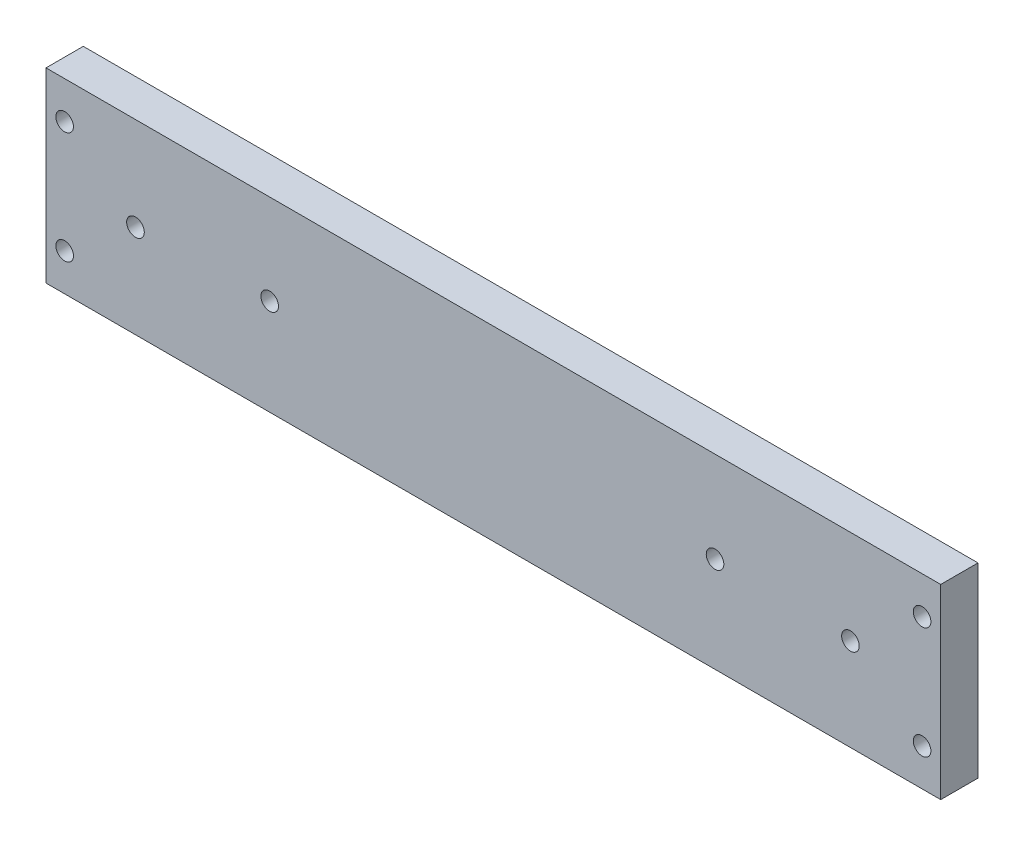
ISO-10303-21;
HEADER;
FILE_DESCRIPTION(('STEP AP214'),'2;1');
FILE_NAME('part.step','',(''),(''),'','','');
FILE_SCHEMA(('AUTOMOTIVE_DESIGN { 1 0 10303 214 1 1 1 1 }'));
ENDSEC;
DATA;
#1=APPLICATION_CONTEXT('core data for automotive mechanical design processes');
#2=APPLICATION_PROTOCOL_DEFINITION('international standard','automotive_design',2000,#1);
#3=PRODUCT_CONTEXT('',#1,'mechanical');
#4=PRODUCT('Part','Part','',(#3));
#5=PRODUCT_RELATED_PRODUCT_CATEGORY('part','',(#4));
#6=PRODUCT_DEFINITION_FORMATION('','',#4);
#7=PRODUCT_DEFINITION_CONTEXT('part definition',#1,'design');
#8=PRODUCT_DEFINITION('design','',#6,#7);
#9=PRODUCT_DEFINITION_SHAPE('','',#8);
#10=(LENGTH_UNIT() NAMED_UNIT(*) SI_UNIT(.MILLI.,.METRE.));
#11=(NAMED_UNIT(*) PLANE_ANGLE_UNIT() SI_UNIT($,.RADIAN.));
#12=(NAMED_UNIT(*) SI_UNIT($,.STERADIAN.) SOLID_ANGLE_UNIT());
#13=UNCERTAINTY_MEASURE_WITH_UNIT(LENGTH_MEASURE(1.E-05),#10,'distance_accuracy_value','');
#14=(GEOMETRIC_REPRESENTATION_CONTEXT(3) GLOBAL_UNCERTAINTY_ASSIGNED_CONTEXT((#13)) GLOBAL_UNIT_ASSIGNED_CONTEXT((#10,
#11,#12)) REPRESENTATION_CONTEXT('',''));
#15=CARTESIAN_POINT('',(0.,0.,0.));
#16=DIRECTION('',(0.,0.,1.));
#17=DIRECTION('',(1.,0.,0.));
#18=AXIS2_PLACEMENT_3D('',#15,#16,#17);
#19=CARTESIAN_POINT('',(-76.2,31.75,0.));
#20=DIRECTION('',(1.,0.,0.));
#21=DIRECTION('',(0.,0.,-1.));
#22=AXIS2_PLACEMENT_3D('',#19,#20,#21);
#23=PLANE('',#22);
#24=DIRECTION('',(0.,0.,1.));
#25=VECTOR('',#24,1.);
#26=CARTESIAN_POINT('',(-76.2,0.,0.));
#27=LINE('',#26,#25);
#28=CARTESIAN_POINT('',(-76.2,0.,0.));
#29=VERTEX_POINT('',#28);
#30=CARTESIAN_POINT('',(-76.2,0.,6.35));
#31=VERTEX_POINT('',#30);
#32=EDGE_CURVE('E141',#29,#31,#27,.T.);
#33=ORIENTED_EDGE('',*,*,#32,.T.);
#34=DIRECTION('',(0.,-1.,0.));
#35=VECTOR('',#34,1.);
#36=CARTESIAN_POINT('',(-76.2,31.75,6.35));
#37=LINE('',#36,#35);
#38=CARTESIAN_POINT('',(-76.2,31.75,6.35));
#39=VERTEX_POINT('',#38);
#40=EDGE_CURVE('E11',#39,#31,#37,.T.);
#41=ORIENTED_EDGE('',*,*,#40,.F.);
#42=DIRECTION('',(0.,0.,1.));
#43=VECTOR('',#42,1.);
#44=CARTESIAN_POINT('',(-76.2,31.75,0.));
#45=LINE('',#44,#43);
#46=CARTESIAN_POINT('',(-76.2,31.75,0.));
#47=VERTEX_POINT('',#46);
#48=EDGE_CURVE('E142',#47,#39,#45,.T.);
#49=ORIENTED_EDGE('',*,*,#48,.F.);
#50=DIRECTION('',(0.,-1.,0.));
#51=VECTOR('',#50,1.);
#52=CARTESIAN_POINT('',(-76.2,31.75,0.));
#53=LINE('',#52,#51);
#54=EDGE_CURVE('E57',#47,#29,#53,.T.);
#55=ORIENTED_EDGE('',*,*,#54,.T.);
#56=EDGE_LOOP('',(#33,#41,#49,#55));
#57=FACE_BOUND('',#56,.T.);
#58=ADVANCED_FACE('F39',(#57),#23,.F.);
#59=CARTESIAN_POINT('',(-76.2,31.75,6.35));
#60=DIRECTION('',(0.,0.,-1.));
#61=DIRECTION('',(-1.,0.,0.));
#62=AXIS2_PLACEMENT_3D('',#59,#60,#61);
#63=PLANE('',#62);
#64=CARTESIAN_POINT('',(-38.1,16.3861335757337,6.34999999999999));
#65=DIRECTION('',(0.,0.,-1.));
#66=DIRECTION('',(-1.,0.,0.));
#67=AXIS2_PLACEMENT_3D('',#64,#65,#66);
#68=CIRCLE('',#67,1.49999999999999);
#69=CARTESIAN_POINT('',(-39.6,16.3861335757337,6.34999999999999));
#70=VERTEX_POINT('',#69);
#71=EDGE_CURVE('E102',#70,#70,#68,.T.);
#72=ORIENTED_EDGE('',*,*,#71,.T.);
#73=EDGE_LOOP('',(#72));
#74=FACE_BOUND('',#73,.T.);
#75=CARTESIAN_POINT('',(37.7608050839104,16.2479661231572,6.34999999999998));
#76=DIRECTION('',(0.,0.,-1.));
#77=DIRECTION('',(-1.,0.,0.));
#78=AXIS2_PLACEMENT_3D('',#75,#76,#77);
#79=CIRCLE('',#78,1.49999999999999);
#80=CARTESIAN_POINT('',(36.2608050839104,16.2479661231572,6.34999999999998));
#81=VERTEX_POINT('',#80);
#82=EDGE_CURVE('E106',#81,#81,#79,.T.);
#83=ORIENTED_EDGE('',*,*,#82,.T.);
#84=EDGE_LOOP('',(#83));
#85=FACE_BOUND('',#84,.T.);
#86=CARTESIAN_POINT('',(60.823726654071,15.7207265192255,6.34999999999998));
#87=DIRECTION('',(0.,0.,-1.));
#88=DIRECTION('',(-1.,0.,0.));
#89=AXIS2_PLACEMENT_3D('',#86,#87,#88);
#90=CIRCLE('',#89,1.49999999999999);
#91=CARTESIAN_POINT('',(59.323726654071,15.7207265192255,6.34999999999998));
#92=VERTEX_POINT('',#91);
#93=EDGE_CURVE('E110',#92,#92,#90,.T.);
#94=ORIENTED_EDGE('',*,*,#93,.T.);
#95=EDGE_LOOP('',(#94));
#96=FACE_BOUND('',#95,.T.);
#97=CARTESIAN_POINT('',(-60.96,15.8750000000001,6.35));
#98=DIRECTION('',(0.,0.,-1.));
#99=DIRECTION('',(-1.,0.,0.));
#100=AXIS2_PLACEMENT_3D('',#97,#98,#99);
#101=CIRCLE('',#100,1.49999999999999);
#102=CARTESIAN_POINT('',(-62.46,15.8750000000001,6.35));
#103=VERTEX_POINT('',#102);
#104=EDGE_CURVE('E114',#103,#103,#101,.T.);
#105=ORIENTED_EDGE('',*,*,#104,.T.);
#106=EDGE_LOOP('',(#105));
#107=FACE_BOUND('',#106,.T.);
#108=CARTESIAN_POINT('',(73.025,25.4,6.34999999999997));
#109=DIRECTION('',(0.,0.,-1.));
#110=DIRECTION('',(-1.,0.,0.));
#111=AXIS2_PLACEMENT_3D('',#108,#109,#110);
#112=CIRCLE('',#111,1.5);
#113=CARTESIAN_POINT('',(71.525,25.4,6.34999999999997));
#114=VERTEX_POINT('',#113);
#115=EDGE_CURVE('E120',#114,#114,#112,.T.);
#116=ORIENTED_EDGE('',*,*,#115,.T.);
#117=EDGE_LOOP('',(#116));
#118=FACE_BOUND('',#117,.T.);
#119=CARTESIAN_POINT('',(73.025,6.35,6.34999999999997));
#120=DIRECTION('',(0.,0.,-1.));
#121=DIRECTION('',(-1.,0.,0.));
#122=AXIS2_PLACEMENT_3D('',#119,#120,#121);
#123=CIRCLE('',#122,1.5);
#124=CARTESIAN_POINT('',(71.525,6.35,6.34999999999997));
#125=VERTEX_POINT('',#124);
#126=EDGE_CURVE('E126',#125,#125,#123,.T.);
#127=ORIENTED_EDGE('',*,*,#126,.T.);
#128=EDGE_LOOP('',(#127));
#129=FACE_BOUND('',#128,.T.);
#130=CARTESIAN_POINT('',(-73.025,25.4,6.35));
#131=DIRECTION('',(0.,0.,-1.));
#132=DIRECTION('',(-1.,0.,0.));
#133=AXIS2_PLACEMENT_3D('',#130,#131,#132);
#134=CIRCLE('',#133,1.5);
#135=CARTESIAN_POINT('',(-74.525,25.4,6.35));
#136=VERTEX_POINT('',#135);
#137=EDGE_CURVE('E132',#136,#136,#134,.T.);
#138=ORIENTED_EDGE('',*,*,#137,.T.);
#139=EDGE_LOOP('',(#138));
#140=FACE_BOUND('',#139,.T.);
#141=CARTESIAN_POINT('',(-73.025,6.35,6.35));
#142=DIRECTION('',(0.,0.,-1.));
#143=DIRECTION('',(-1.,0.,0.));
#144=AXIS2_PLACEMENT_3D('',#141,#142,#143);
#145=CIRCLE('',#144,1.5);
#146=CARTESIAN_POINT('',(-74.525,6.35,6.35));
#147=VERTEX_POINT('',#146);
#148=EDGE_CURVE('E138',#147,#147,#145,.T.);
#149=ORIENTED_EDGE('',*,*,#148,.T.);
#150=EDGE_LOOP('',(#149));
#151=FACE_BOUND('',#150,.T.);
#152=DIRECTION('',(1.,0.,0.));
#153=VECTOR('',#152,1.);
#154=CARTESIAN_POINT('',(-76.2,0.,6.35));
#155=LINE('',#154,#153);
#156=CARTESIAN_POINT('',(76.2,0.,6.34999999999997));
#157=VERTEX_POINT('',#156);
#158=EDGE_CURVE('E152',#31,#157,#155,.T.);
#159=ORIENTED_EDGE('',*,*,#158,.T.);
#160=DIRECTION('',(0.,-1.,0.));
#161=VECTOR('',#160,1.);
#162=CARTESIAN_POINT('',(76.2,31.75,6.34999999999997));
#163=LINE('',#162,#161);
#164=CARTESIAN_POINT('',(76.2,31.75,6.34999999999997));
#165=VERTEX_POINT('',#164);
#166=EDGE_CURVE('E48',#165,#157,#163,.T.);
#167=ORIENTED_EDGE('',*,*,#166,.F.);
#168=DIRECTION('',(1.,0.,0.));
#169=VECTOR('',#168,1.);
#170=CARTESIAN_POINT('',(-76.2,31.75,6.35));
#171=LINE('',#170,#169);
#172=EDGE_CURVE('E83',#39,#165,#171,.T.);
#173=ORIENTED_EDGE('',*,*,#172,.F.);
#174=ORIENTED_EDGE('',*,*,#40,.T.);
#175=EDGE_LOOP('',(#159,#167,#173,#174));
#176=FACE_BOUND('',#175,.T.);
#177=ADVANCED_FACE('F197',(#74,#85,#96,#107,#118,#129,#140,#151,#176),#63,.F.);
#178=CARTESIAN_POINT('',(76.2,31.75,0.));
#179=DIRECTION('',(1.,0.,0.));
#180=DIRECTION('',(0.,0.,-1.));
#181=AXIS2_PLACEMENT_3D('',#178,#179,#180);
#182=PLANE('',#181);
#183=DIRECTION('',(0.,0.,1.));
#184=VECTOR('',#183,1.);
#185=CARTESIAN_POINT('',(76.2,0.,0.));
#186=LINE('',#185,#184);
#187=CARTESIAN_POINT('',(76.2,0.,0.));
#188=VERTEX_POINT('',#187);
#189=EDGE_CURVE('E155',#188,#157,#186,.T.);
#190=ORIENTED_EDGE('',*,*,#189,.F.);
#191=DIRECTION('',(0.,-1.,0.));
#192=VECTOR('',#191,1.);
#193=CARTESIAN_POINT('',(76.2,31.75,0.));
#194=LINE('',#193,#192);
#195=CARTESIAN_POINT('',(76.2,31.75,0.));
#196=VERTEX_POINT('',#195);
#197=EDGE_CURVE('E72',#196,#188,#194,.T.);
#198=ORIENTED_EDGE('',*,*,#197,.F.);
#199=DIRECTION('',(0.,0.,1.));
#200=VECTOR('',#199,1.);
#201=CARTESIAN_POINT('',(76.2,31.75,0.));
#202=LINE('',#201,#200);
#203=EDGE_CURVE('E146',#196,#165,#202,.T.);
#204=ORIENTED_EDGE('',*,*,#203,.T.);
#205=ORIENTED_EDGE('',*,*,#166,.T.);
#206=EDGE_LOOP('',(#190,#198,#204,#205));
#207=FACE_BOUND('',#206,.T.);
#208=ADVANCED_FACE('F177',(#207),#182,.T.);
#209=CARTESIAN_POINT('',(-76.2,31.75,0.));
#210=DIRECTION('',(0.,0.,-1.));
#211=DIRECTION('',(-1.,0.,0.));
#212=AXIS2_PLACEMENT_3D('',#209,#210,#211);
#213=PLANE('',#212);
#214=CARTESIAN_POINT('',(-43.2478956785864,16.3861335757337,0.));
#215=DIRECTION('',(0.,0.,-1.));
#216=DIRECTION('',(-1.,0.,0.));
#217=AXIS2_PLACEMENT_3D('',#214,#215,#216);
#218=CIRCLE('',#217,1.49999999999999);
#219=CARTESIAN_POINT('',(-44.7478956785864,16.3861335757337,0.));
#220=VERTEX_POINT('',#219);
#221=EDGE_CURVE('E42',#220,#220,#218,.T.);
#222=ORIENTED_EDGE('',*,*,#221,.F.);
#223=EDGE_LOOP('',(#222));
#224=FACE_BOUND('',#223,.T.);
#225=CARTESIAN_POINT('',(-38.1,16.3861335757337,0.));
#226=DIRECTION('',(0.,0.,-1.));
#227=DIRECTION('',(-1.,0.,0.));
#228=AXIS2_PLACEMENT_3D('',#225,#226,#227);
#229=CIRCLE('',#228,1.49999999999999);
#230=CARTESIAN_POINT('',(-39.6,16.3861335757337,0.));
#231=VERTEX_POINT('',#230);
#232=EDGE_CURVE('E100',#231,#231,#229,.T.);
#233=ORIENTED_EDGE('',*,*,#232,.F.);
#234=EDGE_LOOP('',(#233));
#235=FACE_BOUND('',#234,.T.);
#236=CARTESIAN_POINT('',(37.7608050839104,16.2479661231572,0.));
#237=DIRECTION('',(0.,0.,-1.));
#238=DIRECTION('',(-1.,0.,0.));
#239=AXIS2_PLACEMENT_3D('',#236,#237,#238);
#240=CIRCLE('',#239,1.49999999999999);
#241=CARTESIAN_POINT('',(36.2608050839104,16.2479661231572,0.));
#242=VERTEX_POINT('',#241);
#243=EDGE_CURVE('E105',#242,#242,#240,.T.);
#244=ORIENTED_EDGE('',*,*,#243,.F.);
#245=EDGE_LOOP('',(#244));
#246=FACE_BOUND('',#245,.T.);
#247=CARTESIAN_POINT('',(60.823726654071,15.7207265192255,0.));
#248=DIRECTION('',(0.,0.,-1.));
#249=DIRECTION('',(-1.,0.,0.));
#250=AXIS2_PLACEMENT_3D('',#247,#248,#249);
#251=CIRCLE('',#250,1.49999999999999);
#252=CARTESIAN_POINT('',(59.323726654071,15.7207265192255,0.));
#253=VERTEX_POINT('',#252);
#254=EDGE_CURVE('E109',#253,#253,#251,.T.);
#255=ORIENTED_EDGE('',*,*,#254,.F.);
#256=EDGE_LOOP('',(#255));
#257=FACE_BOUND('',#256,.T.);
#258=CARTESIAN_POINT('',(-60.96,15.8750000000001,0.));
#259=DIRECTION('',(0.,0.,-1.));
#260=DIRECTION('',(-1.,0.,0.));
#261=AXIS2_PLACEMENT_3D('',#258,#259,#260);
#262=CIRCLE('',#261,1.49999999999999);
#263=CARTESIAN_POINT('',(-62.46,15.8750000000001,0.));
#264=VERTEX_POINT('',#263);
#265=EDGE_CURVE('E113',#264,#264,#262,.T.);
#266=ORIENTED_EDGE('',*,*,#265,.F.);
#267=EDGE_LOOP('',(#266));
#268=FACE_BOUND('',#267,.T.);
#269=CARTESIAN_POINT('',(73.025,25.4,0.));
#270=DIRECTION('',(0.,0.,-1.));
#271=DIRECTION('',(-1.,0.,0.));
#272=AXIS2_PLACEMENT_3D('',#269,#270,#271);
#273=CIRCLE('',#272,1.5);
#274=CARTESIAN_POINT('',(71.525,25.4,0.));
#275=VERTEX_POINT('',#274);
#276=EDGE_CURVE('E117',#275,#275,#273,.T.);
#277=ORIENTED_EDGE('',*,*,#276,.F.);
#278=EDGE_LOOP('',(#277));
#279=FACE_BOUND('',#278,.T.);
#280=CARTESIAN_POINT('',(73.025,6.35,0.));
#281=DIRECTION('',(0.,0.,-1.));
#282=DIRECTION('',(-1.,0.,0.));
#283=AXIS2_PLACEMENT_3D('',#280,#281,#282);
#284=CIRCLE('',#283,1.5);
#285=CARTESIAN_POINT('',(71.525,6.35,0.));
#286=VERTEX_POINT('',#285);
#287=EDGE_CURVE('E123',#286,#286,#284,.T.);
#288=ORIENTED_EDGE('',*,*,#287,.F.);
#289=EDGE_LOOP('',(#288));
#290=FACE_BOUND('',#289,.T.);
#291=CARTESIAN_POINT('',(-73.025,25.4,0.));
#292=DIRECTION('',(0.,0.,-1.));
#293=DIRECTION('',(-1.,0.,0.));
#294=AXIS2_PLACEMENT_3D('',#291,#292,#293);
#295=CIRCLE('',#294,1.5);
#296=CARTESIAN_POINT('',(-74.525,25.4,0.));
#297=VERTEX_POINT('',#296);
#298=EDGE_CURVE('E129',#297,#297,#295,.T.);
#299=ORIENTED_EDGE('',*,*,#298,.F.);
#300=EDGE_LOOP('',(#299));
#301=FACE_BOUND('',#300,.T.);
#302=CARTESIAN_POINT('',(-73.025,6.35,0.));
#303=DIRECTION('',(0.,0.,-1.));
#304=DIRECTION('',(-1.,0.,0.));
#305=AXIS2_PLACEMENT_3D('',#302,#303,#304);
#306=CIRCLE('',#305,1.5);
#307=CARTESIAN_POINT('',(-74.525,6.35,0.));
#308=VERTEX_POINT('',#307);
#309=EDGE_CURVE('E135',#308,#308,#306,.T.);
#310=ORIENTED_EDGE('',*,*,#309,.F.);
#311=EDGE_LOOP('',(#310));
#312=FACE_BOUND('',#311,.T.);
#313=DIRECTION('',(1.,0.,0.));
#314=VECTOR('',#313,1.);
#315=CARTESIAN_POINT('',(-76.2,0.,0.));
#316=LINE('',#315,#314);
#317=EDGE_CURVE('E144',#29,#188,#316,.T.);
#318=ORIENTED_EDGE('',*,*,#317,.F.);
#319=ORIENTED_EDGE('',*,*,#54,.F.);
#320=DIRECTION('',(1.,0.,0.));
#321=VECTOR('',#320,1.);
#322=CARTESIAN_POINT('',(-76.2,31.75,0.));
#323=LINE('',#322,#321);
#324=EDGE_CURVE('E149',#47,#196,#323,.T.);
#325=ORIENTED_EDGE('',*,*,#324,.T.);
#326=ORIENTED_EDGE('',*,*,#197,.T.);
#327=EDGE_LOOP('',(#318,#319,#325,#326));
#328=FACE_BOUND('',#327,.T.);
#329=ADVANCED_FACE('F173',(#224,#235,#246,#257,#268,#279,#290,#301,#312,#328),#213,.T.);
#330=CARTESIAN_POINT('',(0.,31.75,0.));
#331=DIRECTION('',(0.,1.,0.));
#332=DIRECTION('',(0.,0.,1.));
#333=AXIS2_PLACEMENT_3D('',#330,#331,#332);
#334=PLANE('',#333);
#335=ORIENTED_EDGE('',*,*,#48,.T.);
#336=ORIENTED_EDGE('',*,*,#172,.T.);
#337=ORIENTED_EDGE('',*,*,#203,.F.);
#338=ORIENTED_EDGE('',*,*,#324,.F.);
#339=EDGE_LOOP('',(#335,#336,#337,#338));
#340=FACE_BOUND('',#339,.T.);
#341=ADVANCED_FACE('F176',(#340),#334,.T.);
#342=CARTESIAN_POINT('',(0.,0.,0.));
#343=DIRECTION('',(0.,1.,0.));
#344=DIRECTION('',(0.,0.,1.));
#345=AXIS2_PLACEMENT_3D('',#342,#343,#344);
#346=PLANE('',#345);
#347=ORIENTED_EDGE('',*,*,#32,.F.);
#348=ORIENTED_EDGE('',*,*,#317,.T.);
#349=ORIENTED_EDGE('',*,*,#189,.T.);
#350=ORIENTED_EDGE('',*,*,#158,.F.);
#351=EDGE_LOOP('',(#347,#348,#349,#350));
#352=FACE_BOUND('',#351,.T.);
#353=ADVANCED_FACE('F194',(#352),#346,.F.);
#354=CARTESIAN_POINT('',(-73.025,6.35,0.));
#355=DIRECTION('',(0.,0.,-1.));
#356=DIRECTION('',(-1.,0.,0.));
#357=AXIS2_PLACEMENT_3D('',#354,#355,#356);
#358=CYLINDRICAL_SURFACE('',#357,1.5);
#359=ORIENTED_EDGE('',*,*,#309,.T.);
#360=EDGE_LOOP('',(#359));
#361=FACE_BOUND('',#360,.T.);
#362=ORIENTED_EDGE('',*,*,#148,.F.);
#363=EDGE_LOOP('',(#362));
#364=FACE_BOUND('',#363,.T.);
#365=ADVANCED_FACE('F206',(#361,#364),#358,.F.);
#366=CARTESIAN_POINT('',(-73.025,25.4,0.));
#367=DIRECTION('',(0.,0.,-1.));
#368=DIRECTION('',(-1.,0.,0.));
#369=AXIS2_PLACEMENT_3D('',#366,#367,#368);
#370=CYLINDRICAL_SURFACE('',#369,1.5);
#371=ORIENTED_EDGE('',*,*,#298,.T.);
#372=EDGE_LOOP('',(#371));
#373=FACE_BOUND('',#372,.T.);
#374=ORIENTED_EDGE('',*,*,#137,.F.);
#375=EDGE_LOOP('',(#374));
#376=FACE_BOUND('',#375,.T.);
#377=ADVANCED_FACE('F235',(#373,#376),#370,.F.);
#378=CARTESIAN_POINT('',(73.025,6.35,0.));
#379=DIRECTION('',(0.,0.,-1.));
#380=DIRECTION('',(-1.,0.,0.));
#381=AXIS2_PLACEMENT_3D('',#378,#379,#380);
#382=CYLINDRICAL_SURFACE('',#381,1.5);
#383=ORIENTED_EDGE('',*,*,#287,.T.);
#384=EDGE_LOOP('',(#383));
#385=FACE_BOUND('',#384,.T.);
#386=ORIENTED_EDGE('',*,*,#126,.F.);
#387=EDGE_LOOP('',(#386));
#388=FACE_BOUND('',#387,.T.);
#389=ADVANCED_FACE('F240',(#385,#388),#382,.F.);
#390=CARTESIAN_POINT('',(73.025,25.4,0.));
#391=DIRECTION('',(0.,0.,-1.));
#392=DIRECTION('',(-1.,0.,0.));
#393=AXIS2_PLACEMENT_3D('',#390,#391,#392);
#394=CYLINDRICAL_SURFACE('',#393,1.5);
#395=ORIENTED_EDGE('',*,*,#276,.T.);
#396=EDGE_LOOP('',(#395));
#397=FACE_BOUND('',#396,.T.);
#398=ORIENTED_EDGE('',*,*,#115,.F.);
#399=EDGE_LOOP('',(#398));
#400=FACE_BOUND('',#399,.T.);
#401=ADVANCED_FACE('F246',(#397,#400),#394,.F.);
#402=CARTESIAN_POINT('',(-60.96,15.8750000000001,-2.54));
#403=DIRECTION('',(0.,0.,-1.));
#404=DIRECTION('',(0.,1.,0.));
#405=AXIS2_PLACEMENT_3D('',#402,#403,#404);
#406=CYLINDRICAL_SURFACE('',#405,1.49999999999999);
#407=ORIENTED_EDGE('',*,*,#265,.T.);
#408=EDGE_LOOP('',(#407));
#409=FACE_BOUND('',#408,.T.);
#410=ORIENTED_EDGE('',*,*,#104,.F.);
#411=EDGE_LOOP('',(#410));
#412=FACE_BOUND('',#411,.T.);
#413=ADVANCED_FACE('F250',(#409,#412),#406,.F.);
#414=CARTESIAN_POINT('',(60.823726654071,15.7207265192255,-2.54000000000002));
#415=DIRECTION('',(0.,0.,-1.));
#416=DIRECTION('',(0.,1.,0.));
#417=AXIS2_PLACEMENT_3D('',#414,#415,#416);
#418=CYLINDRICAL_SURFACE('',#417,1.49999999999999);
#419=ORIENTED_EDGE('',*,*,#254,.T.);
#420=EDGE_LOOP('',(#419));
#421=FACE_BOUND('',#420,.T.);
#422=ORIENTED_EDGE('',*,*,#93,.F.);
#423=EDGE_LOOP('',(#422));
#424=FACE_BOUND('',#423,.T.);
#425=ADVANCED_FACE('F254',(#421,#424),#418,.F.);
#426=CARTESIAN_POINT('',(37.7608050839104,16.2479661231572,-2.54000000000002));
#427=DIRECTION('',(0.,0.,-1.));
#428=DIRECTION('',(0.,1.,0.));
#429=AXIS2_PLACEMENT_3D('',#426,#427,#428);
#430=CYLINDRICAL_SURFACE('',#429,1.49999999999999);
#431=ORIENTED_EDGE('',*,*,#243,.T.);
#432=EDGE_LOOP('',(#431));
#433=FACE_BOUND('',#432,.T.);
#434=ORIENTED_EDGE('',*,*,#82,.F.);
#435=EDGE_LOOP('',(#434));
#436=FACE_BOUND('',#435,.T.);
#437=ADVANCED_FACE('F258',(#433,#436),#430,.F.);
#438=CARTESIAN_POINT('',(-38.1,16.3861335757337,-2.53999999999999));
#439=DIRECTION('',(0.,0.,-1.));
#440=DIRECTION('',(0.,1.,0.));
#441=AXIS2_PLACEMENT_3D('',#438,#439,#440);
#442=CYLINDRICAL_SURFACE('',#441,1.49999999999999);
#443=ORIENTED_EDGE('',*,*,#232,.T.);
#444=EDGE_LOOP('',(#443));
#445=FACE_BOUND('',#444,.T.);
#446=ORIENTED_EDGE('',*,*,#71,.F.);
#447=EDGE_LOOP('',(#446));
#448=FACE_BOUND('',#447,.T.);
#449=ADVANCED_FACE('F92',(#445,#448),#442,.F.);
#450=CARTESIAN_POINT('',(-43.2478956785864,16.3861335757337,0.186037407301156));
#451=DIRECTION('',(0.,0.,-1.));
#452=DIRECTION('',(0.,1.,0.));
#453=AXIS2_PLACEMENT_3D('',#450,#451,#452);
#454=CONICAL_SURFACE('',#453,1.5,1.02974425867665);
#455=CARTESIAN_POINT('',(-43.2478956785864,16.3861335757337,1.0873283358425));
#456=VERTEX_POINT('',#455);
#457=VERTEX_LOOP('',#456);
#458=FACE_BOUND('',#457,.T.);
#459=CARTESIAN_POINT('',(-43.2478956785864,16.3861335757337,0.186037407301156));
#460=DIRECTION('',(0.,0.,-1.));
#461=DIRECTION('',(0.,1.,0.));
#462=AXIS2_PLACEMENT_3D('',#459,#460,#461);
#463=CIRCLE('',#462,1.5);
#464=CARTESIAN_POINT('',(-43.2478956785864,17.8861335757337,0.186037407301156));
#465=VERTEX_POINT('',#464);
#466=EDGE_CURVE('E96',#465,#465,#463,.T.);
#467=ORIENTED_EDGE('',*,*,#466,.T.);
#468=EDGE_LOOP('',(#467));
#469=FACE_BOUND('',#468,.T.);
#470=ADVANCED_FACE('F88',(#458,#469),#454,.F.);
#471=CARTESIAN_POINT('',(-43.2478956785864,16.3861335757337,-12.5139625926988));
#472=DIRECTION('',(0.,0.,-1.));
#473=DIRECTION('',(0.,1.,0.));
#474=AXIS2_PLACEMENT_3D('',#471,#472,#473);
#475=CYLINDRICAL_SURFACE('',#474,1.49999999999999);
#476=ORIENTED_EDGE('',*,*,#221,.T.);
#477=EDGE_LOOP('',(#476));
#478=FACE_BOUND('',#477,.T.);
#479=ORIENTED_EDGE('',*,*,#466,.F.);
#480=EDGE_LOOP('',(#479));
#481=FACE_BOUND('',#480,.T.);
#482=ADVANCED_FACE('F91',(#478,#481),#475,.F.);
#483=CLOSED_SHELL('',(#58,#177,#208,#329,#341,#353,#365,#377,#389,#401,#413,#425,#437,#449,#470,#482));
#484=MANIFOLD_SOLID_BREP('B2',#483);
#485=ADVANCED_BREP_SHAPE_REPRESENTATION('',(#18,#484),#14);
#486=SHAPE_DEFINITION_REPRESENTATION(#9,#485);
ENDSEC;
END-ISO-10303-21;
